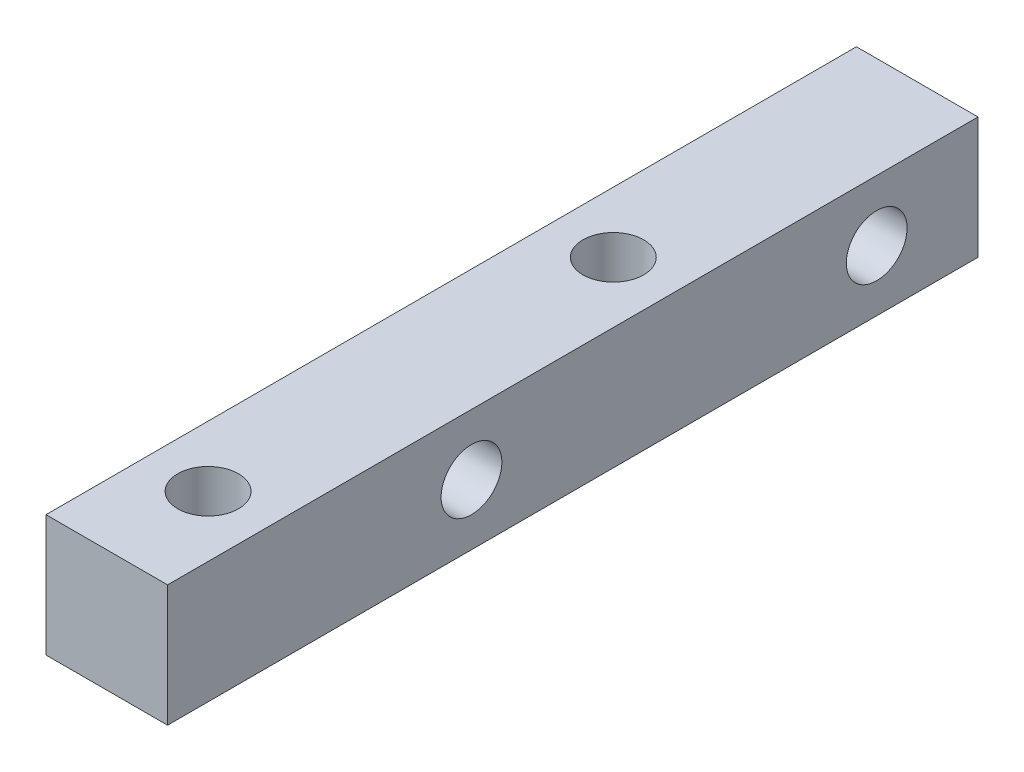
ISO-10303-21;
HEADER;
FILE_DESCRIPTION(('STEP AP214'),'2;1');
FILE_NAME('part.step','',(''),(''),'','','');
FILE_SCHEMA(('AUTOMOTIVE_DESIGN { 1 0 10303 214 1 1 1 1 }'));
ENDSEC;
DATA;
#1=APPLICATION_CONTEXT('core data for automotive mechanical design processes');
#2=APPLICATION_PROTOCOL_DEFINITION('international standard','automotive_design',2000,#1);
#3=PRODUCT_CONTEXT('',#1,'mechanical');
#4=PRODUCT('Part','Part','',(#3));
#5=PRODUCT_RELATED_PRODUCT_CATEGORY('part','',(#4));
#6=PRODUCT_DEFINITION_FORMATION('','',#4);
#7=PRODUCT_DEFINITION_CONTEXT('part definition',#1,'design');
#8=PRODUCT_DEFINITION('design','',#6,#7);
#9=PRODUCT_DEFINITION_SHAPE('','',#8);
#10=(LENGTH_UNIT() NAMED_UNIT(*) SI_UNIT(.MILLI.,.METRE.));
#11=(NAMED_UNIT(*) PLANE_ANGLE_UNIT() SI_UNIT($,.RADIAN.));
#12=(NAMED_UNIT(*) SI_UNIT($,.STERADIAN.) SOLID_ANGLE_UNIT());
#13=UNCERTAINTY_MEASURE_WITH_UNIT(LENGTH_MEASURE(1.E-05),#10,'distance_accuracy_value','');
#14=(GEOMETRIC_REPRESENTATION_CONTEXT(3) GLOBAL_UNCERTAINTY_ASSIGNED_CONTEXT((#13)) GLOBAL_UNIT_ASSIGNED_CONTEXT((#10,
#11,#12)) REPRESENTATION_CONTEXT('',''));
#15=CARTESIAN_POINT('',(0.,0.,0.));
#16=DIRECTION('',(0.,0.,1.));
#17=DIRECTION('',(1.,0.,0.));
#18=AXIS2_PLACEMENT_3D('',#15,#16,#17);
#19=CARTESIAN_POINT('',(3.,3.,40.));
#20=DIRECTION('',(-1.,0.,0.));
#21=DIRECTION('',(0.,-1.,0.));
#22=AXIS2_PLACEMENT_3D('',#19,#20,#21);
#23=PLANE('',#22);
#24=CARTESIAN_POINT('',(3.,0.,5.));
#25=DIRECTION('',(-1.,0.,0.));
#26=DIRECTION('',(0.,-1.,0.));
#27=AXIS2_PLACEMENT_3D('',#24,#25,#26);
#28=CIRCLE('',#27,1.5);
#29=CARTESIAN_POINT('',(3.,-1.5,5.));
#30=VERTEX_POINT('',#29);
#31=EDGE_CURVE('E114',#30,#30,#28,.T.);
#32=ORIENTED_EDGE('',*,*,#31,.T.);
#33=EDGE_LOOP('',(#32));
#34=FACE_BOUND('',#33,.T.);
#35=CARTESIAN_POINT('',(3.,0.,25.));
#36=DIRECTION('',(-1.,0.,0.));
#37=DIRECTION('',(0.,-1.,0.));
#38=AXIS2_PLACEMENT_3D('',#35,#36,#37);
#39=CIRCLE('',#38,1.5);
#40=CARTESIAN_POINT('',(3.,-1.5,25.));
#41=VERTEX_POINT('',#40);
#42=EDGE_CURVE('E131',#41,#41,#39,.T.);
#43=ORIENTED_EDGE('',*,*,#42,.T.);
#44=EDGE_LOOP('',(#43));
#45=FACE_BOUND('',#44,.T.);
#46=DIRECTION('',(0.,1.,0.));
#47=VECTOR('',#46,1.);
#48=CARTESIAN_POINT('',(3.,3.,0.));
#49=LINE('',#48,#47);
#50=CARTESIAN_POINT('',(3.,-3.,0.));
#51=VERTEX_POINT('',#50);
#52=CARTESIAN_POINT('',(3.,3.,0.));
#53=VERTEX_POINT('',#52);
#54=EDGE_CURVE('E110',#51,#53,#49,.T.);
#55=ORIENTED_EDGE('',*,*,#54,.T.);
#56=DIRECTION('',(0.,0.,-1.));
#57=VECTOR('',#56,1.);
#58=CARTESIAN_POINT('',(3.,3.,40.));
#59=LINE('',#58,#57);
#60=CARTESIAN_POINT('',(3.,3.,40.));
#61=VERTEX_POINT('',#60);
#62=EDGE_CURVE('E11',#61,#53,#59,.T.);
#63=ORIENTED_EDGE('',*,*,#62,.F.);
#64=DIRECTION('',(0.,1.,0.));
#65=VECTOR('',#64,1.);
#66=CARTESIAN_POINT('',(3.,3.,40.));
#67=LINE('',#66,#65);
#68=CARTESIAN_POINT('',(3.,-3.,40.));
#69=VERTEX_POINT('',#68);
#70=EDGE_CURVE('E94',#69,#61,#67,.T.);
#71=ORIENTED_EDGE('',*,*,#70,.F.);
#72=DIRECTION('',(0.,0.,-1.));
#73=VECTOR('',#72,1.);
#74=CARTESIAN_POINT('',(3.,-3.,40.));
#75=LINE('',#74,#73);
#76=EDGE_CURVE('E106',#69,#51,#75,.T.);
#77=ORIENTED_EDGE('',*,*,#76,.T.);
#78=EDGE_LOOP('',(#55,#63,#71,#77));
#79=FACE_BOUND('',#78,.T.);
#80=ADVANCED_FACE('F42',(#34,#45,#79),#23,.F.);
#81=CARTESIAN_POINT('',(-3.,3.,40.));
#82=DIRECTION('',(0.,-1.,0.));
#83=DIRECTION('',(0.,0.,-1.));
#84=AXIS2_PLACEMENT_3D('',#81,#82,#83);
#85=PLANE('',#84);
#86=CARTESIAN_POINT('',(0.,3.,15.));
#87=DIRECTION('',(0.,1.,0.));
#88=DIRECTION('',(0.,0.,1.));
#89=AXIS2_PLACEMENT_3D('',#86,#87,#88);
#90=CIRCLE('',#89,1.5);
#91=CARTESIAN_POINT('',(0.,3.,16.5));
#92=VERTEX_POINT('',#91);
#93=EDGE_CURVE('E155',#92,#92,#90,.T.);
#94=ORIENTED_EDGE('',*,*,#93,.F.);
#95=EDGE_LOOP('',(#94));
#96=FACE_BOUND('',#95,.T.);
#97=CARTESIAN_POINT('',(0.,3.,35.));
#98=DIRECTION('',(0.,1.,0.));
#99=DIRECTION('',(0.,0.,1.));
#100=AXIS2_PLACEMENT_3D('',#97,#98,#99);
#101=CIRCLE('',#100,1.5);
#102=CARTESIAN_POINT('',(0.,3.,36.5));
#103=VERTEX_POINT('',#102);
#104=EDGE_CURVE('E151',#103,#103,#101,.T.);
#105=ORIENTED_EDGE('',*,*,#104,.F.);
#106=EDGE_LOOP('',(#105));
#107=FACE_BOUND('',#106,.T.);
#108=DIRECTION('',(-1.,0.,0.));
#109=VECTOR('',#108,1.);
#110=CARTESIAN_POINT('',(-3.,3.,0.));
#111=LINE('',#110,#109);
#112=CARTESIAN_POINT('',(-3.,3.,0.));
#113=VERTEX_POINT('',#112);
#114=EDGE_CURVE('E99',#53,#113,#111,.T.);
#115=ORIENTED_EDGE('',*,*,#114,.T.);
#116=DIRECTION('',(0.,0.,-1.));
#117=VECTOR('',#116,1.);
#118=CARTESIAN_POINT('',(-3.,3.,40.));
#119=LINE('',#118,#117);
#120=CARTESIAN_POINT('',(-3.,3.,40.));
#121=VERTEX_POINT('',#120);
#122=EDGE_CURVE('E51',#121,#113,#119,.T.);
#123=ORIENTED_EDGE('',*,*,#122,.F.);
#124=DIRECTION('',(-1.,0.,0.));
#125=VECTOR('',#124,1.);
#126=CARTESIAN_POINT('',(-3.,3.,40.));
#127=LINE('',#126,#125);
#128=EDGE_CURVE('E89',#61,#121,#127,.T.);
#129=ORIENTED_EDGE('',*,*,#128,.F.);
#130=ORIENTED_EDGE('',*,*,#62,.T.);
#131=EDGE_LOOP('',(#115,#123,#129,#130));
#132=FACE_BOUND('',#131,.T.);
#133=ADVANCED_FACE('F98',(#96,#107,#132),#85,.F.);
#134=CARTESIAN_POINT('',(-3.,3.,40.));
#135=DIRECTION('',(1.,0.,0.));
#136=DIRECTION('',(0.,1.,0.));
#137=AXIS2_PLACEMENT_3D('',#134,#135,#136);
#138=PLANE('',#137);
#139=CARTESIAN_POINT('',(-3.,0.,5.));
#140=DIRECTION('',(-1.,0.,0.));
#141=DIRECTION('',(0.,-1.,0.));
#142=AXIS2_PLACEMENT_3D('',#139,#140,#141);
#143=CIRCLE('',#142,1.5);
#144=CARTESIAN_POINT('',(-3.,-1.5,5.));
#145=VERTEX_POINT('',#144);
#146=EDGE_CURVE('E140',#145,#145,#143,.T.);
#147=ORIENTED_EDGE('',*,*,#146,.F.);
#148=EDGE_LOOP('',(#147));
#149=FACE_BOUND('',#148,.T.);
#150=CARTESIAN_POINT('',(-3.,0.,25.));
#151=DIRECTION('',(-1.,0.,0.));
#152=DIRECTION('',(0.,-1.,0.));
#153=AXIS2_PLACEMENT_3D('',#150,#151,#152);
#154=CIRCLE('',#153,1.5);
#155=CARTESIAN_POINT('',(-3.,-1.5,25.));
#156=VERTEX_POINT('',#155);
#157=EDGE_CURVE('E135',#156,#156,#154,.T.);
#158=ORIENTED_EDGE('',*,*,#157,.F.);
#159=EDGE_LOOP('',(#158));
#160=FACE_BOUND('',#159,.T.);
#161=DIRECTION('',(0.,-1.,0.));
#162=VECTOR('',#161,1.);
#163=CARTESIAN_POINT('',(-3.,3.,0.));
#164=LINE('',#163,#162);
#165=CARTESIAN_POINT('',(-3.,-3.,0.));
#166=VERTEX_POINT('',#165);
#167=EDGE_CURVE('E76',#113,#166,#164,.T.);
#168=ORIENTED_EDGE('',*,*,#167,.T.);
#169=DIRECTION('',(0.,0.,-1.));
#170=VECTOR('',#169,1.);
#171=CARTESIAN_POINT('',(-3.,-3.,40.));
#172=LINE('',#171,#170);
#173=CARTESIAN_POINT('',(-3.,-3.,40.));
#174=VERTEX_POINT('',#173);
#175=EDGE_CURVE('E101',#174,#166,#172,.T.);
#176=ORIENTED_EDGE('',*,*,#175,.F.);
#177=DIRECTION('',(0.,-1.,0.));
#178=VECTOR('',#177,1.);
#179=CARTESIAN_POINT('',(-3.,3.,40.));
#180=LINE('',#179,#178);
#181=EDGE_CURVE('E92',#121,#174,#180,.T.);
#182=ORIENTED_EDGE('',*,*,#181,.F.);
#183=ORIENTED_EDGE('',*,*,#122,.T.);
#184=EDGE_LOOP('',(#168,#176,#182,#183));
#185=FACE_BOUND('',#184,.T.);
#186=ADVANCED_FACE('F102',(#149,#160,#185),#138,.F.);
#187=CARTESIAN_POINT('',(-3.,-3.,40.));
#188=DIRECTION('',(0.,1.,0.));
#189=DIRECTION('',(0.,0.,1.));
#190=AXIS2_PLACEMENT_3D('',#187,#188,#189);
#191=PLANE('',#190);
#192=CARTESIAN_POINT('',(0.,-3.,15.));
#193=DIRECTION('',(0.,1.,0.));
#194=DIRECTION('',(0.,0.,1.));
#195=AXIS2_PLACEMENT_3D('',#192,#193,#194);
#196=CIRCLE('',#195,1.5);
#197=CARTESIAN_POINT('',(0.,-3.,16.5));
#198=VERTEX_POINT('',#197);
#199=EDGE_CURVE('E136',#198,#198,#196,.T.);
#200=ORIENTED_EDGE('',*,*,#199,.T.);
#201=EDGE_LOOP('',(#200));
#202=FACE_BOUND('',#201,.T.);
#203=CARTESIAN_POINT('',(0.,-3.,35.));
#204=DIRECTION('',(0.,1.,0.));
#205=DIRECTION('',(0.,0.,1.));
#206=AXIS2_PLACEMENT_3D('',#203,#204,#205);
#207=CIRCLE('',#206,1.5);
#208=CARTESIAN_POINT('',(0.,-3.,36.5));
#209=VERTEX_POINT('',#208);
#210=EDGE_CURVE('E147',#209,#209,#207,.T.);
#211=ORIENTED_EDGE('',*,*,#210,.T.);
#212=EDGE_LOOP('',(#211));
#213=FACE_BOUND('',#212,.T.);
#214=DIRECTION('',(1.,0.,0.));
#215=VECTOR('',#214,1.);
#216=CARTESIAN_POINT('',(-3.,-3.,0.));
#217=LINE('',#216,#215);
#218=EDGE_CURVE('E82',#166,#51,#217,.T.);
#219=ORIENTED_EDGE('',*,*,#218,.T.);
#220=ORIENTED_EDGE('',*,*,#76,.F.);
#221=DIRECTION('',(1.,0.,0.));
#222=VECTOR('',#221,1.);
#223=CARTESIAN_POINT('',(-3.,-3.,40.));
#224=LINE('',#223,#222);
#225=EDGE_CURVE('E59',#174,#69,#224,.T.);
#226=ORIENTED_EDGE('',*,*,#225,.F.);
#227=ORIENTED_EDGE('',*,*,#175,.T.);
#228=EDGE_LOOP('',(#219,#220,#226,#227));
#229=FACE_BOUND('',#228,.T.);
#230=ADVANCED_FACE('F124',(#202,#213,#229),#191,.F.);
#231=CARTESIAN_POINT('',(0.,0.,40.));
#232=DIRECTION('',(0.,0.,1.));
#233=DIRECTION('',(1.,0.,0.));
#234=AXIS2_PLACEMENT_3D('',#231,#232,#233);
#235=PLANE('',#234);
#236=ORIENTED_EDGE('',*,*,#70,.T.);
#237=ORIENTED_EDGE('',*,*,#128,.T.);
#238=ORIENTED_EDGE('',*,*,#181,.T.);
#239=ORIENTED_EDGE('',*,*,#225,.T.);
#240=EDGE_LOOP('',(#236,#237,#238,#239));
#241=FACE_BOUND('',#240,.T.);
#242=ADVANCED_FACE('F90',(#241),#235,.T.);
#243=CARTESIAN_POINT('',(0.,0.,0.));
#244=DIRECTION('',(0.,0.,1.));
#245=DIRECTION('',(1.,0.,0.));
#246=AXIS2_PLACEMENT_3D('',#243,#244,#245);
#247=PLANE('',#246);
#248=ORIENTED_EDGE('',*,*,#54,.F.);
#249=ORIENTED_EDGE('',*,*,#218,.F.);
#250=ORIENTED_EDGE('',*,*,#167,.F.);
#251=ORIENTED_EDGE('',*,*,#114,.F.);
#252=EDGE_LOOP('',(#248,#249,#250,#251));
#253=FACE_BOUND('',#252,.T.);
#254=ADVANCED_FACE('F127',(#253),#247,.F.);
#255=CARTESIAN_POINT('',(3.,0.,25.));
#256=DIRECTION('',(-1.,0.,0.));
#257=DIRECTION('',(0.,-1.,0.));
#258=AXIS2_PLACEMENT_3D('',#255,#256,#257);
#259=CYLINDRICAL_SURFACE('',#258,1.5);
#260=ORIENTED_EDGE('',*,*,#42,.F.);
#261=EDGE_LOOP('',(#260));
#262=FACE_BOUND('',#261,.T.);
#263=ORIENTED_EDGE('',*,*,#157,.T.);
#264=EDGE_LOOP('',(#263));
#265=FACE_BOUND('',#264,.T.);
#266=ADVANCED_FACE('F183',(#262,#265),#259,.F.);
#267=CARTESIAN_POINT('',(3.,0.,5.));
#268=DIRECTION('',(-1.,0.,0.));
#269=DIRECTION('',(0.,-1.,0.));
#270=AXIS2_PLACEMENT_3D('',#267,#268,#269);
#271=CYLINDRICAL_SURFACE('',#270,1.5);
#272=ORIENTED_EDGE('',*,*,#31,.F.);
#273=EDGE_LOOP('',(#272));
#274=FACE_BOUND('',#273,.T.);
#275=ORIENTED_EDGE('',*,*,#146,.T.);
#276=EDGE_LOOP('',(#275));
#277=FACE_BOUND('',#276,.T.);
#278=ADVANCED_FACE('F177',(#274,#277),#271,.F.);
#279=CARTESIAN_POINT('',(0.,-3.,35.));
#280=DIRECTION('',(0.,1.,0.));
#281=DIRECTION('',(0.,0.,1.));
#282=AXIS2_PLACEMENT_3D('',#279,#280,#281);
#283=CYLINDRICAL_SURFACE('',#282,1.5);
#284=ORIENTED_EDGE('',*,*,#210,.F.);
#285=EDGE_LOOP('',(#284));
#286=FACE_BOUND('',#285,.T.);
#287=ORIENTED_EDGE('',*,*,#104,.T.);
#288=EDGE_LOOP('',(#287));
#289=FACE_BOUND('',#288,.T.);
#290=ADVANCED_FACE('F168',(#286,#289),#283,.F.);
#291=CARTESIAN_POINT('',(0.,-3.,15.));
#292=DIRECTION('',(0.,1.,0.));
#293=DIRECTION('',(0.,0.,1.));
#294=AXIS2_PLACEMENT_3D('',#291,#292,#293);
#295=CYLINDRICAL_SURFACE('',#294,1.5);
#296=ORIENTED_EDGE('',*,*,#199,.F.);
#297=EDGE_LOOP('',(#296));
#298=FACE_BOUND('',#297,.T.);
#299=ORIENTED_EDGE('',*,*,#93,.T.);
#300=EDGE_LOOP('',(#299));
#301=FACE_BOUND('',#300,.T.);
#302=ADVANCED_FACE('F165',(#298,#301),#295,.F.);
#303=CLOSED_SHELL('',(#80,#133,#186,#230,#242,#254,#266,#278,#290,#302));
#304=MANIFOLD_SOLID_BREP('B2',#303);
#305=ADVANCED_BREP_SHAPE_REPRESENTATION('',(#18,#304),#14);
#306=SHAPE_DEFINITION_REPRESENTATION(#9,#305);
ENDSEC;
END-ISO-10303-21;
